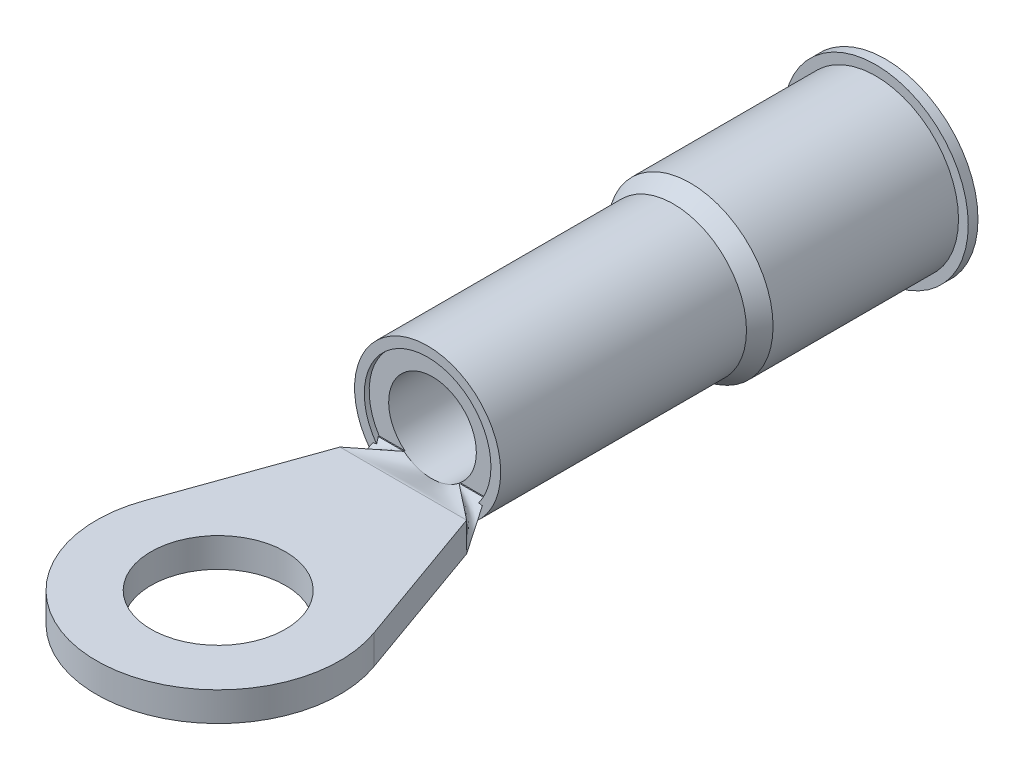
ISO-10303-21;
HEADER;
FILE_DESCRIPTION(('STEP AP214'),'2;1');
FILE_NAME('part.step','',(''),(''),'','','');
FILE_SCHEMA(('AUTOMOTIVE_DESIGN { 1 0 10303 214 1 1 1 1 }'));
ENDSEC;
DATA;
#1=APPLICATION_CONTEXT('core data for automotive mechanical design processes');
#2=APPLICATION_PROTOCOL_DEFINITION('international standard','automotive_design',2000,#1);
#3=PRODUCT_CONTEXT('',#1,'mechanical');
#4=PRODUCT('Part','Part','',(#3));
#5=PRODUCT_RELATED_PRODUCT_CATEGORY('part','',(#4));
#6=PRODUCT_DEFINITION_FORMATION('','',#4);
#7=PRODUCT_DEFINITION_CONTEXT('part definition',#1,'design');
#8=PRODUCT_DEFINITION('design','',#6,#7);
#9=PRODUCT_DEFINITION_SHAPE('','',#8);
#10=(LENGTH_UNIT() NAMED_UNIT(*) SI_UNIT(.MILLI.,.METRE.));
#11=(NAMED_UNIT(*) PLANE_ANGLE_UNIT() SI_UNIT($,.RADIAN.));
#12=(NAMED_UNIT(*) SI_UNIT($,.STERADIAN.) SOLID_ANGLE_UNIT());
#13=UNCERTAINTY_MEASURE_WITH_UNIT(LENGTH_MEASURE(1.E-05),#10,'distance_accuracy_value','');
#14=(GEOMETRIC_REPRESENTATION_CONTEXT(3) GLOBAL_UNCERTAINTY_ASSIGNED_CONTEXT((#13)) GLOBAL_UNIT_ASSIGNED_CONTEXT((#10,
#11,#12)) REPRESENTATION_CONTEXT('',''));
#15=CARTESIAN_POINT('',(0.,0.,0.));
#16=DIRECTION('',(0.,0.,1.));
#17=DIRECTION('',(1.,0.,0.));
#18=AXIS2_PLACEMENT_3D('',#15,#16,#17);
#19=CARTESIAN_POINT('',(-1.39121529606312,0.762,0.0254));
#20=CARTESIAN_POINT('',(-1.47781019737541,0.508,0.270933333333333));
#21=CARTESIAN_POINT('',(-1.56440509868771,0.254,0.516466666666667));
#22=CARTESIAN_POINT('',(-1.651,0.,0.762));
#23=CARTESIAN_POINT('',(-1.23955403655532,0.524662020194092,0.0254));
#24=CARTESIAN_POINT('',(-1.28498046881466,0.349774680129394,0.270933333333333));
#25=CARTESIAN_POINT('',(-1.330406901074,0.174887340064697,0.516466666666667));
#26=CARTESIAN_POINT('',(-1.37583333333333,0.,0.762));
#27=CARTESIAN_POINT('',(-0.83014051960649,0.143662020194092,0.0254));
#28=CARTESIAN_POINT('',(-0.82859367973766,0.0957746801293947,0.270933333333334));
#29=CARTESIAN_POINT('',(-0.82704683986883,0.0478873400646973,0.516466666666667));
#30=CARTESIAN_POINT('',(-0.8255,0.,0.762000000000001));
#31=CARTESIAN_POINT('',(0.,-0.0718310100970455,0.0254));
#32=CARTESIAN_POINT('',(0.,-0.047887340064697,0.270933333333333));
#33=CARTESIAN_POINT('',(0.,-0.0239436700323485,0.516466666666666));
#34=CARTESIAN_POINT('',(0.,0.,0.761999999999999));
#35=CARTESIAN_POINT('',(0.830140519606489,0.143662020194092,0.0254));
#36=CARTESIAN_POINT('',(0.828593679737659,0.0957746801293948,0.270933333333334));
#37=CARTESIAN_POINT('',(0.82704683986883,0.0478873400646974,0.516466666666667));
#38=CARTESIAN_POINT('',(0.8255,0.,0.762000000000001));
#39=CARTESIAN_POINT('',(1.23955403655532,0.524662020194091,0.0254));
#40=CARTESIAN_POINT('',(1.28498046881466,0.349774680129394,0.270933333333333));
#41=CARTESIAN_POINT('',(1.33040690107399,0.174887340064697,0.516466666666667));
#42=CARTESIAN_POINT('',(1.37583333333333,0.,0.762));
#43=CARTESIAN_POINT('',(1.39121529606312,0.761999999999999,0.0254));
#44=CARTESIAN_POINT('',(1.47781019737541,0.507999999999999,0.270933333333333));
#45=CARTESIAN_POINT('',(1.56440509868771,0.254,0.516466666666667));
#46=CARTESIAN_POINT('',(1.651,0.,0.762));
#47=B_SPLINE_SURFACE_WITH_KNOTS('',3,3,((#19,#20,#21,#22),(#23,#24,#25,#26),(#27,#28,#29,#30),
(#31,#32,#33,#34),(#35,#36,#37,#38),(#39,#40,#41,#42),(#43,#44,#45,#46)),.UNSPECIFIED.,.F.,.F.,
.F.,(4,1,1,1,4),(4,4),(0.,0.25,0.5,0.75,1.),(0.,1.),.UNSPECIFIED.);
#48=DIRECTION('',(0.238073071200388,0.698315480109153,-0.675038297438848));
#49=VECTOR('',#48,1.);
#50=CARTESIAN_POINT('',(-1.52110764803156,0.381,0.3937));
#51=LINE('',#50,#49);
#52=CARTESIAN_POINT('',(-1.651,0.,0.762));
#53=VERTEX_POINT('',#52);
#54=CARTESIAN_POINT('',(-1.42704766901993,0.656896551724138,0.127));
#55=VERTEX_POINT('',#54);
#56=EDGE_CURVE('E434',#53,#55,#51,.T.);
#57=CARTESIAN_POINT('',(-1.42704766901993,0.656896551724138,0.127));
#58=CARTESIAN_POINT('',(-1.39758191727476,0.621156019971046,0.127));
#59=CARTESIAN_POINT('',(-1.36669044147473,0.586618245457012,0.127));
#60=CARTESIAN_POINT('',(-1.30226329544282,0.520120364949861,0.127));
#61=CARTESIAN_POINT('',(-1.26872829772447,0.488159607520618,0.127));
#62=CARTESIAN_POINT('',(-1.16467924988584,0.396580652700039,0.127));
#63=CARTESIAN_POINT('',(-1.09052003773562,0.341023025084146,0.127));
#64=CARTESIAN_POINT('',(-0.929285470756384,0.238650935944051,0.127));
#65=CARTESIAN_POINT('',(-0.841675094746148,0.192685818214404,0.127));
#66=CARTESIAN_POINT('',(-0.66019061468465,0.115126560731954,0.127));
#67=CARTESIAN_POINT('',(-0.566309895673391,0.0835478816903494,0.127));
#68=CARTESIAN_POINT('',(-0.419844299965997,0.046371900769037,0.127));
#69=CARTESIAN_POINT('',(-0.368524098851723,0.0355340390327336,0.127));
#70=CARTESIAN_POINT('',(-0.265161649147126,0.0180561265052614,0.127));
#71=CARTESIAN_POINT('',(-0.213119427639096,0.0114159186968148,0.127));
#72=CARTESIAN_POINT('',(-0.108673566363522,0.00244437797419004,0.127));
#73=CARTESIAN_POINT('',(-0.0562699914721443,0.000112290822558793,0.127));
#74=CARTESIAN_POINT('',(0.0485457382792517,-0.000104238741521693,0.127));
#75=CARTESIAN_POINT('',(0.100957893091223,0.00201129473777937,0.127));
#76=CARTESIAN_POINT('',(0.206524326884028,0.0106467655091575,0.127));
#77=CARTESIAN_POINT('',(0.259671166651413,0.0172579957355603,0.127));
#78=CARTESIAN_POINT('',(0.36522394835596,0.0348561880133288,0.127));
#79=CARTESIAN_POINT('',(0.417629799086765,0.0458436839551839,0.127));
#80=CARTESIAN_POINT('',(0.573297522248406,0.0852546919277909,0.127));
#81=CARTESIAN_POINT('',(0.675022386288336,0.120127802259419,0.127));
#82=CARTESIAN_POINT('',(0.871986667874733,0.20731871631408,0.127));
#83=CARTESIAN_POINT('',(0.967144592048948,0.259820057509265,0.127));
#84=CARTESIAN_POINT('',(1.14626155002175,0.381128771582777,0.127));
#85=CARTESIAN_POINT('',(1.23024869613362,0.449893953605291,0.127));
#86=CARTESIAN_POINT('',(1.3281697677111,0.546529322523483,0.127));
#87=CARTESIAN_POINT('',(1.34874781009383,0.567905132476543,0.127));
#88=CARTESIAN_POINT('',(1.38875775940492,0.611655903662194,0.127));
#89=CARTESIAN_POINT('',(1.40819103259336,0.634029615454349,0.127));
#90=CARTESIAN_POINT('',(1.42704766901993,0.656896551724137,0.127));
#91=B_SPLINE_CURVE_WITH_KNOTS('',3,(#57,#58,#59,#60,#61,#62,#63,#64,#65,#66,#67,#68,#69,#70,#71,
#72,#73,#74,#75,#76,#77,#78,#79,#80,#81,#82,#83,#84,#85,#86,#87,#88,#89,#90),.UNSPECIFIED.,.F.,
.F.,(4,2,2,2,2,2,2,2,2,2,2,2,2,2,2,2,4),(0.,0.138884387927252,0.277733556910216,
0.554496905000208,0.850044656744678,1.14590928062392,1.30312528168604,1.46033540158456,
1.61751799555905,1.77469973753025,1.93517258639134,2.09566501842866,2.41661173840474,
2.74100934772726,3.06457447663388,3.15356286656676,3.24244280408155),.UNSPECIFIED.);
#92=CARTESIAN_POINT('',(1.42704766901993,0.656896551724138,0.127));
#93=VERTEX_POINT('',#92);
#94=EDGE_CURVE('E186',#55,#93,#91,.T.);
#95=DIRECTION('',(0.238073071200388,-0.698315480109153,0.675038297438848));
#96=VECTOR('',#95,1.);
#97=CARTESIAN_POINT('',(1.52110764803156,0.381,0.3937));
#98=LINE('',#97,#96);
#99=CARTESIAN_POINT('',(1.651,0.,0.762));
#100=VERTEX_POINT('',#99);
#101=EDGE_CURVE('E432',#93,#100,#98,.T.);
#102=DIRECTION('',(1.,0.,0.));
#103=VECTOR('',#102,1.);
#104=CARTESIAN_POINT('',(0.,0.,0.762));
#105=LINE('',#104,#103);
#106=EDGE_CURVE('E407',#100,#53,#105,.F.);
#107=ORIENTED_EDGE('',*,*,#56,.T.);
#108=ORIENTED_EDGE('',*,*,#94,.T.);
#109=ORIENTED_EDGE('',*,*,#101,.T.);
#110=ORIENTED_EDGE('',*,*,#106,.T.);
#111=EDGE_LOOP('',(#107,#108,#109,#110));
#112=FACE_BOUND('',#111,.T.);
#113=ADVANCED_FACE('F80',(#112),#47,.T.);
#114=CARTESIAN_POINT('',(-0.718420489685532,0.761999999999999,0.0254));
#115=CARTESIAN_POINT('',(-1.02928032645702,0.762,0.270933333333333));
#116=CARTESIAN_POINT('',(-1.34014016322851,0.762,0.516466666666667));
#117=CARTESIAN_POINT('',(-1.651,0.762,0.762));
#118=CARTESIAN_POINT('',(-0.774486723550331,0.761999999999999,0.0254));
#119=CARTESIAN_POINT('',(-1.06665781570022,0.740833333333333,0.270933333333333));
#120=CARTESIAN_POINT('',(-1.35882890785011,0.719666666666666,0.516466666666667));
#121=CARTESIAN_POINT('',(-1.651,0.6985,0.762));
#122=CARTESIAN_POINT('',(-0.88661919127993,0.761999999999999,0.0254));
#123=CARTESIAN_POINT('',(-1.14141279418662,0.6985,0.270933333333333));
#124=CARTESIAN_POINT('',(-1.39620639709331,0.635,0.516466666666666));
#125=CARTESIAN_POINT('',(-1.651,0.5715,0.762));
#126=CARTESIAN_POINT('',(-1.05481789287433,0.762,0.0254));
#127=CARTESIAN_POINT('',(-1.25354526191622,0.635,0.270933333333334));
#128=CARTESIAN_POINT('',(-1.45227263095811,0.508,0.516466666666668));
#129=CARTESIAN_POINT('',(-1.651,0.381,0.762000000000001));
#130=CARTESIAN_POINT('',(-1.22301659446872,0.761999999999999,0.0254));
#131=CARTESIAN_POINT('',(-1.36567772964582,0.5715,0.270933333333333));
#132=CARTESIAN_POINT('',(-1.50833886482291,0.381,0.516466666666666));
#133=CARTESIAN_POINT('',(-1.651,0.1905,0.761999999999999));
#134=CARTESIAN_POINT('',(-1.33514906219832,0.761999999999999,0.0254));
#135=CARTESIAN_POINT('',(-1.44043270813221,0.529166666666666,0.270933333333333));
#136=CARTESIAN_POINT('',(-1.54571635406611,0.296333333333333,0.516466666666667));
#137=CARTESIAN_POINT('',(-1.651,0.0635000000000003,0.762));
#138=CARTESIAN_POINT('',(-1.39121529606312,0.761999999999999,0.0254));
#139=CARTESIAN_POINT('',(-1.47781019737541,0.508,0.270933333333333));
#140=CARTESIAN_POINT('',(-1.56440509868771,0.254,0.516466666666667));
#141=CARTESIAN_POINT('',(-1.651,0.,0.762));
#142=B_SPLINE_SURFACE_WITH_KNOTS('',3,3,((#114,#115,#116,#117),(#118,#119,#120,#121),(#122,#123,
#124,#125),(#126,#127,#128,#129),(#130,#131,#132,#133),(#134,#135,#136,#137),(#138,#139,#140,
#141)),.UNSPECIFIED.,.F.,.F.,.F.,(4,1,1,1,4),(4,4),(0.809457468958157,0.857093101718618,
0.904728734479079,0.952364367239539,1.),(0.,1.),.UNSPECIFIED.);
#143=CARTESIAN_POINT('',(-1.39121529606312,0.762,0.0253999999999994));
#144=CARTESIAN_POINT('',(-1.38608855288108,0.753975647520577,0.0331610564142781));
#145=CARTESIAN_POINT('',(-1.38094789781283,0.746085406524645,0.0410563370567257));
#146=CARTESIAN_POINT('',(-1.3707085552637,0.730650018927489,0.0571622428158725));
#147=CARTESIAN_POINT('',(-1.36560980035942,0.723104151700813,0.0653721364053272));
#148=CARTESIAN_POINT('',(-1.3554998256097,0.708396876537606,0.0821896660357152));
#149=CARTESIAN_POINT('',(-1.35048862622041,0.701235557656195,0.0907973933569945));
#150=CARTESIAN_POINT('',(-1.34063818539088,0.687379878571269,0.108509285916107));
#151=CARTESIAN_POINT('',(-1.33579934700954,0.680686581615087,0.117614502831048));
#152=CARTESIAN_POINT('',(-1.33109964648684,0.674283699776335,0.126999999999995));
#153=B_SPLINE_CURVE_WITH_KNOTS('',3,(#143,#144,#145,#146,#147,#148,#149,#150,#151,#152),
.UNSPECIFIED.,.F.,.F.,(4,2,2,2,4),(0.,0.0368561073399838,0.0736311779630064,0.110414728684775,
0.147279297482322),.UNSPECIFIED.);
#154=CARTESIAN_POINT('',(-1.39121529606312,0.762,0.0254000000000001));
#155=VERTEX_POINT('',#154);
#156=CARTESIAN_POINT('',(-1.33109964648684,0.674283699776336,0.127));
#157=VERTEX_POINT('',#156);
#158=EDGE_CURVE('E176',#155,#157,#153,.T.);
#159=CARTESIAN_POINT('',(-0.847052146280631,0.761999999999999,0.127));
#160=CARTESIAN_POINT('',(-0.89873164530666,0.75263493882306,0.127));
#161=CARTESIAN_POINT('',(-0.950411144332689,0.74326987764612,0.127));
#162=CARTESIAN_POINT('',(-1.05377014238475,0.724539755292241,0.127));
#163=CARTESIAN_POINT('',(-1.10544964141078,0.715174694115301,0.127));
#164=CARTESIAN_POINT('',(-1.24710198329785,0.68950527253362,0.127));
#165=CARTESIAN_POINT('',(-1.33707482615889,0.673200912128879,0.127));
#166=CARTESIAN_POINT('',(-1.42704766901993,0.656896551724137,0.127));
#167=B_SPLINE_CURVE_WITH_KNOTS('',3,(#159,#160,#161,#162,#163,#164,#165,#166),.UNSPECIFIED.,.F.,
.F.,(4,2,2,4),(0.,0.157563558330797,0.315127116661593,0.589441719966538),.UNSPECIFIED.);
#168=EDGE_CURVE('E310',#157,#55,#167,.T.);
#169=DIRECTION('',(0.,1.,0.));
#170=VECTOR('',#169,1.);
#171=CARTESIAN_POINT('',(-1.651,0.762,0.762));
#172=LINE('',#171,#170);
#173=CARTESIAN_POINT('',(-1.651,0.762,0.761999999999999));
#174=VERTEX_POINT('',#173);
#175=EDGE_CURVE('E420',#174,#53,#172,.F.);
#176=DIRECTION('',(-0.784738272337792,0.,0.619827269429393));
#177=VECTOR('',#176,1.);
#178=CARTESIAN_POINT('',(-1.18471024484277,0.762,0.3937));
#179=LINE('',#178,#177);
#180=CARTESIAN_POINT('',(-0.718420489685532,0.762,0.0254));
#181=VERTEX_POINT('',#180);
#182=EDGE_CURVE('E206',#181,#174,#179,.T.);
#183=DIRECTION('',(-1.,0.,0.));
#184=VECTOR('',#183,1.);
#185=CARTESIAN_POINT('',(-0.718420489685532,0.761999999999999,0.0254));
#186=LINE('',#185,#184);
#187=EDGE_CURVE('E194',#181,#155,#186,.T.);
#188=ORIENTED_EDGE('',*,*,#158,.T.);
#189=ORIENTED_EDGE('',*,*,#168,.T.);
#190=ORIENTED_EDGE('',*,*,#56,.F.);
#191=ORIENTED_EDGE('',*,*,#175,.F.);
#192=ORIENTED_EDGE('',*,*,#182,.F.);
#193=ORIENTED_EDGE('',*,*,#187,.T.);
#194=EDGE_LOOP('',(#188,#189,#190,#191,#192,#193));
#195=FACE_BOUND('',#194,.T.);
#196=ADVANCED_FACE('F203',(#195),#142,.T.);
#197=CARTESIAN_POINT('',(0.718420489685532,0.761999999999999,0.0254));
#198=CARTESIAN_POINT('',(1.02928032645702,0.762,0.270933333333333));
#199=CARTESIAN_POINT('',(1.34014016322851,0.762,0.516466666666667));
#200=CARTESIAN_POINT('',(1.651,0.762,0.762));
#201=CARTESIAN_POINT('',(0.617715486250442,0.680618067624724,0.0254));
#202=CARTESIAN_POINT('',(0.870421435278072,0.707745378416483,0.270933333333333));
#203=CARTESIAN_POINT('',(1.1231273843057,0.734872689208241,0.516466666666667));
#204=CARTESIAN_POINT('',(1.37583333333333,0.762,0.762));
#205=CARTESIAN_POINT('',(0.388426025516563,0.552394071071588,0.0254000000000001));
#206=CARTESIAN_POINT('',(0.534117350344376,0.622262714047725,0.270933333333333));
#207=CARTESIAN_POINT('',(0.679808675172188,0.692131357023863,0.516466666666667));
#208=CARTESIAN_POINT('',(0.825500000000001,0.762,0.762));
#209=CARTESIAN_POINT('',(0.,0.485773897218784,0.0254));
#210=CARTESIAN_POINT('',(0.,0.577849264812523,0.270933333333333));
#211=CARTESIAN_POINT('',(0.,0.669924632406261,0.516466666666667));
#212=CARTESIAN_POINT('',(0.,0.762,0.762));
#213=CARTESIAN_POINT('',(-0.388426025516564,0.552394071071588,0.0254));
#214=CARTESIAN_POINT('',(-0.534117350344376,0.622262714047725,0.270933333333333));
#215=CARTESIAN_POINT('',(-0.679808675172188,0.692131357023863,0.516466666666667));
#216=CARTESIAN_POINT('',(-0.8255,0.762,0.762));
#217=CARTESIAN_POINT('',(-0.617715486250443,0.680618067624724,0.0254));
#218=CARTESIAN_POINT('',(-0.870421435278073,0.707745378416483,0.270933333333333));
#219=CARTESIAN_POINT('',(-1.1231273843057,0.734872689208241,0.516466666666667));
#220=CARTESIAN_POINT('',(-1.37583333333333,0.762,0.762));
#221=CARTESIAN_POINT('',(-0.718420489685532,0.761999999999999,0.0254));
#222=CARTESIAN_POINT('',(-1.02928032645702,0.762,0.270933333333333));
#223=CARTESIAN_POINT('',(-1.34014016322851,0.762,0.516466666666667));
#224=CARTESIAN_POINT('',(-1.651,0.762,0.762));
#225=B_SPLINE_SURFACE_WITH_KNOTS('',3,3,((#197,#198,#199,#200),(#201,#202,#203,#204),(#205,#206,
#207,#208),(#209,#210,#211,#212),(#213,#214,#215,#216),(#217,#218,#219,#220),(#221,#222,#223,
#224)),.UNSPECIFIED.,.F.,.F.,.F.,(4,1,1,1,4),(4,4),(0.190542531041843,0.345271265520921,0.5,
0.654728734479079,0.809457468958157),(0.,1.),.UNSPECIFIED.);
#226=CARTESIAN_POINT('',(0.,1.651,0.0254));
#227=DIRECTION('',(0.,0.,-1.));
#228=DIRECTION('',(1.,0.,0.));
#229=AXIS2_PLACEMENT_3D('',#226,#227,#228);
#230=CIRCLE('',#229,1.143);
#231=CARTESIAN_POINT('',(0.718420489685532,0.761999999999999,0.0254));
#232=VERTEX_POINT('',#231);
#233=CARTESIAN_POINT('',(0.280093594641271,0.542819573389863,0.0254));
#234=VERTEX_POINT('',#233);
#235=EDGE_CURVE('E208',#232,#234,#230,.T.);
#236=CARTESIAN_POINT('',(0.280086317799953,0.542848090476192,0.0254));
#237=CARTESIAN_POINT('',(0.274435453146551,0.541419829924682,0.0253898757300014));
#238=CARTESIAN_POINT('',(0.268773634953075,0.540034876181237,0.0253815517042047));
#239=CARTESIAN_POINT('',(0.256810333648759,0.537205395040891,0.025367029172351));
#240=CARTESIAN_POINT('',(0.250506484126485,0.535770865005437,0.0253611618348143));
#241=CARTESIAN_POINT('',(0.237253661374286,0.532873047210581,0.0253515275315568));
#242=CARTESIAN_POINT('',(0.23030226611733,0.531420828445981,0.0253480241666326));
#243=CARTESIAN_POINT('',(0.215749315169803,0.528521761640067,0.0253431953071069));
#244=CARTESIAN_POINT('',(0.208145337102078,0.527087064644947,0.0253420931933865));
#245=CARTESIAN_POINT('',(0.192282898443226,0.52426052919858,0.0253420952879215));
#246=CARTESIAN_POINT('',(0.184022076020688,0.522881934751302,0.0253433885339403));
#247=CARTESIAN_POINT('',(0.166842658096937,0.520208501393833,0.0253482149334854));
#248=CARTESIAN_POINT('',(0.157921827716278,0.518928010945526,0.0253519109914221));
#249=CARTESIAN_POINT('',(0.139420476007071,0.516495147330165,0.025361559850228));
#250=CARTESIAN_POINT('',(0.129837918764648,0.515358239536721,0.0253676537671633));
#251=CARTESIAN_POINT('',(0.110012945822629,0.513260419584125,0.025382142066703));
#252=CARTESIAN_POINT('',(0.0997687718967419,0.512316102862729,0.0253906618603731));
#253=CARTESIAN_POINT('',(0.0895136704791261,0.511510507816197,0.0254));
#254=B_SPLINE_CURVE_WITH_KNOTS('',3,(#236,#237,#238,#239,#240,#241,#242,#243,#244,#245,#246,
#247,#248,#249,#250,#251,#252,#253),.UNSPECIFIED.,.F.,.F.,(4,2,2,2,2,2,2,2,4),(0.,
0.0174855734570703,0.0368796879760257,0.0581828587489586,0.0813956904950005,0.10651886566124,
0.133553138647615,0.162499343526083,0.193358425668611),.UNSPECIFIED.);
#255=CARTESIAN_POINT('',(0.089516606997273,0.511472074409526,0.0254));
#256=VERTEX_POINT('',#255);
#257=EDGE_CURVE('E13',#234,#256,#254,.T.);
#258=CARTESIAN_POINT('',(0.718420489685532,0.761999999999999,0.0254));
#259=CARTESIAN_POINT('',(0.617715486250442,0.680618067624724,0.0254));
#260=CARTESIAN_POINT('',(0.388426025516563,0.552394071071588,0.0254000000000001));
#261=CARTESIAN_POINT('',(0.,0.485773897218784,0.0254));
#262=CARTESIAN_POINT('',(-0.388426025516564,0.552394071071588,0.0254));
#263=CARTESIAN_POINT('',(-0.617715486250443,0.680618067624724,0.0254));
#264=CARTESIAN_POINT('',(-0.718420489685532,0.761999999999999,0.0254));
#265=B_SPLINE_CURVE_WITH_KNOTS('',3,(#258,#259,#260,#261,#262,#263,#264),.UNSPECIFIED.,.F.,.F.,
(4,1,1,1,4),(0.190542531041843,0.345271265520921,0.5,0.654728734479079,0.809457468958157),.UNSPECIFIED.);
#266=CARTESIAN_POINT('',(-0.0895153171618941,0.51148892797954,0.0254));
#267=VERTEX_POINT('',#266);
#268=EDGE_CURVE('E199',#256,#267,#265,.T.);
#269=CARTESIAN_POINT('',(-0.0895136706448394,0.511510507829265,0.0254));
#270=CARTESIAN_POINT('',(-0.0997687720410653,0.512316102875615,0.0253906618603894));
#271=CARTESIAN_POINT('',(-0.110012945945588,0.513260419596252,0.0253821420667349));
#272=CARTESIAN_POINT('',(-0.1298379188475,0.515358239546391,0.0253676537672216));
#273=CARTESIAN_POINT('',(-0.139420476071171,0.516495147338236,0.0253615598502975));
#274=CARTESIAN_POINT('',(-0.157921827745502,0.518928010949762,0.025351910991509));
#275=CARTESIAN_POINT('',(-0.166842658110025,0.520208501395922,0.0253482149335793));
#276=CARTESIAN_POINT('',(-0.184022076004126,0.52288193474873,0.0253433885340428));
#277=CARTESIAN_POINT('',(-0.192282898413135,0.524260529193574,0.0253420952880267));
#278=CARTESIAN_POINT('',(-0.208145337047529,0.527087064634951,0.0253420931934917));
#279=CARTESIAN_POINT('',(-0.215749315104312,0.528521761627587,0.0253431953072103));
#280=CARTESIAN_POINT('',(-0.230302266032525,0.531420828428625,0.0253480241667272));
#281=CARTESIAN_POINT('',(-0.237253661281096,0.532873047190899,0.0253515275316453));
#282=CARTESIAN_POINT('',(-0.250506484019064,0.535770864981382,0.0253611618348855));
#283=CARTESIAN_POINT('',(-0.256810333535479,0.537205395014848,0.0253670291724122));
#284=CARTESIAN_POINT('',(-0.268773634830581,0.540034876151665,0.0253815517042392));
#285=CARTESIAN_POINT('',(-0.27443545302069,0.541419829893615,0.0253898757300211));
#286=CARTESIAN_POINT('',(-0.280086317670744,0.542848090443578,0.0254));
#287=B_SPLINE_CURVE_WITH_KNOTS('',3,(#269,#270,#271,#272,#273,#274,#275,#276,#277,#278,#279,
#280,#281,#282,#283,#284,#285,#286),.UNSPECIFIED.,.F.,.F.,(4,2,2,2,2,2,2,2,4),(0.,
0.0308590820785189,0.0598052869005761,0.0868395598381356,0.111962734963151,0.135175566675559,
0.156478737422446,0.175872851922941,0.193358425369136),.UNSPECIFIED.);
#288=CARTESIAN_POINT('',(-0.280097541124282,0.542804046174763,0.0254));
#289=VERTEX_POINT('',#288);
#290=EDGE_CURVE('E91',#267,#289,#287,.T.);
#291=CARTESIAN_POINT('',(0.718420489685532,0.761999999999999,0.0254));
#292=CARTESIAN_POINT('',(0.617715486250442,0.680618067624724,0.0254));
#293=CARTESIAN_POINT('',(0.388426025516563,0.552394071071588,0.0254000000000001));
#294=CARTESIAN_POINT('',(0.,0.485773897218784,0.0254));
#295=CARTESIAN_POINT('',(-0.388426025516564,0.552394071071588,0.0254));
#296=CARTESIAN_POINT('',(-0.617715486250443,0.680618067624724,0.0254));
#297=CARTESIAN_POINT('',(-0.718420489685532,0.761999999999999,0.0254));
#298=B_SPLINE_CURVE_WITH_KNOTS('',3,(#291,#292,#293,#294,#295,#296,#297),.UNSPECIFIED.,.F.,.F.,
(4,1,1,1,4),(0.190542531041843,0.345271265520921,0.5,0.654728734479079,0.809457468958157),.UNSPECIFIED.);
#299=EDGE_CURVE('E334',#289,#181,#298,.T.);
#300=DIRECTION('',(1.,0.,0.));
#301=VECTOR('',#300,1.);
#302=CARTESIAN_POINT('',(0.,0.762,0.762));
#303=LINE('',#302,#301);
#304=CARTESIAN_POINT('',(1.651,0.762,0.762));
#305=VERTEX_POINT('',#304);
#306=EDGE_CURVE('E423',#305,#174,#303,.F.);
#307=DIRECTION('',(0.784738272337792,0.,0.619827269429393));
#308=VECTOR('',#307,1.);
#309=CARTESIAN_POINT('',(1.18471024484277,0.762,0.3937));
#310=LINE('',#309,#308);
#311=EDGE_CURVE('E302',#232,#305,#310,.T.);
#312=ORIENTED_EDGE('',*,*,#235,.T.);
#313=ORIENTED_EDGE('',*,*,#257,.T.);
#314=ORIENTED_EDGE('',*,*,#268,.T.);
#315=ORIENTED_EDGE('',*,*,#290,.T.);
#316=ORIENTED_EDGE('',*,*,#299,.T.);
#317=ORIENTED_EDGE('',*,*,#182,.T.);
#318=ORIENTED_EDGE('',*,*,#306,.F.);
#319=ORIENTED_EDGE('',*,*,#311,.F.);
#320=EDGE_LOOP('',(#312,#313,#314,#315,#316,#317,#318,#319));
#321=FACE_BOUND('',#320,.T.);
#322=ADVANCED_FACE('F232',(#321),#225,.T.);
#323=CARTESIAN_POINT('',(1.39121529606312,0.761999999999999,0.0254));
#324=CARTESIAN_POINT('',(1.47781019737541,0.508,0.270933333333333));
#325=CARTESIAN_POINT('',(1.56440509868771,0.254,0.516466666666667));
#326=CARTESIAN_POINT('',(1.651,0.,0.762));
#327=CARTESIAN_POINT('',(1.33514906219832,0.761999999999999,0.0254));
#328=CARTESIAN_POINT('',(1.44043270813221,0.529166666666666,0.270933333333333));
#329=CARTESIAN_POINT('',(1.54571635406611,0.296333333333333,0.516466666666667));
#330=CARTESIAN_POINT('',(1.651,0.0635000000000002,0.762));
#331=CARTESIAN_POINT('',(1.22301659446872,0.761999999999999,0.0254));
#332=CARTESIAN_POINT('',(1.36567772964582,0.571499999999999,0.270933333333333));
#333=CARTESIAN_POINT('',(1.50833886482291,0.381,0.516466666666667));
#334=CARTESIAN_POINT('',(1.651,0.1905,0.762));
#335=CARTESIAN_POINT('',(1.05481789287433,0.762000000000001,0.0254));
#336=CARTESIAN_POINT('',(1.25354526191622,0.635,0.270933333333334));
#337=CARTESIAN_POINT('',(1.45227263095811,0.508000000000001,0.516466666666667));
#338=CARTESIAN_POINT('',(1.651,0.381000000000001,0.762000000000001));
#339=CARTESIAN_POINT('',(0.886619191279928,0.761999999999998,0.0254));
#340=CARTESIAN_POINT('',(1.14141279418662,0.698499999999999,0.270933333333333));
#341=CARTESIAN_POINT('',(1.39620639709331,0.634999999999999,0.516466666666666));
#342=CARTESIAN_POINT('',(1.651,0.5715,0.761999999999999));
#343=CARTESIAN_POINT('',(0.774486723550331,0.761999999999999,0.0254));
#344=CARTESIAN_POINT('',(1.06665781570022,0.740833333333333,0.270933333333333));
#345=CARTESIAN_POINT('',(1.35882890785011,0.719666666666667,0.516466666666667));
#346=CARTESIAN_POINT('',(1.651,0.6985,0.762));
#347=CARTESIAN_POINT('',(0.718420489685532,0.761999999999999,0.0254));
#348=CARTESIAN_POINT('',(1.02928032645702,0.762,0.270933333333333));
#349=CARTESIAN_POINT('',(1.34014016322851,0.762,0.516466666666667));
#350=CARTESIAN_POINT('',(1.651,0.762,0.762));
#351=B_SPLINE_SURFACE_WITH_KNOTS('',3,3,((#323,#324,#325,#326),(#327,#328,#329,#330),(#331,#332,
#333,#334),(#335,#336,#337,#338),(#339,#340,#341,#342),(#343,#344,#345,#346),(#347,#348,#349,
#350)),.UNSPECIFIED.,.F.,.F.,.F.,(4,1,1,1,4),(4,4),(0.,0.0476356327604607,0.0952712655209215,
0.142906898281382,0.190542531041843),(0.,1.),.UNSPECIFIED.);
#352=CARTESIAN_POINT('',(1.42704766901993,0.656896551724138,0.127));
#353=CARTESIAN_POINT('',(1.3753681699939,0.666261612901078,0.127));
#354=CARTESIAN_POINT('',(1.32368867096786,0.675626674078019,0.127));
#355=CARTESIAN_POINT('',(1.22032967291579,0.6943567964319,0.127));
#356=CARTESIAN_POINT('',(1.16865017388976,0.703721857608841,0.127));
#357=CARTESIAN_POINT('',(1.02699783200269,0.729391279190522,0.127));
#358=CARTESIAN_POINT('',(0.937024989141662,0.745695639595261,0.127));
#359=CARTESIAN_POINT('',(0.847052146280631,0.762,0.127));
#360=B_SPLINE_CURVE_WITH_KNOTS('',3,(#352,#353,#354,#355,#356,#357,#358,#359),.UNSPECIFIED.,.F.,
.F.,(4,2,2,4),(0.,0.157563558330814,0.315127116661628,0.58944171996654),.UNSPECIFIED.);
#361=CARTESIAN_POINT('',(1.33109964649123,0.674283699782314,0.127));
#362=VERTEX_POINT('',#361);
#363=EDGE_CURVE('E271',#93,#362,#360,.T.);
#364=CARTESIAN_POINT('',(1.33109964649391,0.674283699780344,0.12699999999676));
#365=CARTESIAN_POINT('',(1.33579934701372,0.680686581618788,0.117614502826859));
#366=CARTESIAN_POINT('',(1.34063818539373,0.68737987857469,0.108509285911823));
#367=CARTESIAN_POINT('',(1.35048862622201,0.701235557659042,0.0907973933532686));
#368=CARTESIAN_POINT('',(1.35549982561136,0.708396876540158,0.0821896660326391));
#369=CARTESIAN_POINT('',(1.36560980036082,0.723104151702711,0.0653721364033144));
#370=CARTESIAN_POINT('',(1.37070855526479,0.730650018929025,0.057162242814273));
#371=CARTESIAN_POINT('',(1.38094789781329,0.746085406525429,0.041056337055906));
#372=CARTESIAN_POINT('',(1.38608855288121,0.753975647520971,0.0331610564138253));
#373=CARTESIAN_POINT('',(1.39121529606312,0.761999999999999,0.0254));
#374=B_SPLINE_CURVE_WITH_KNOTS('',3,(#364,#365,#366,#367,#368,#369,#370,#371,#372,#373),
.UNSPECIFIED.,.F.,.F.,(4,2,2,2,4),(0.,0.0368645687957489,0.0736481195156765,0.110423190136819,
0.147279297474967),.UNSPECIFIED.);
#375=CARTESIAN_POINT('',(1.39121529606312,0.761999999999999,0.0254));
#376=VERTEX_POINT('',#375);
#377=EDGE_CURVE('E269',#362,#376,#374,.T.);
#378=DIRECTION('',(-1.,0.,0.));
#379=VECTOR('',#378,1.);
#380=CARTESIAN_POINT('',(1.39121529606312,0.761999999999999,0.0254));
#381=LINE('',#380,#379);
#382=EDGE_CURVE('E84',#376,#232,#381,.T.);
#383=DIRECTION('',(0.,1.,0.));
#384=VECTOR('',#383,1.);
#385=CARTESIAN_POINT('',(1.651,0.762,0.762));
#386=LINE('',#385,#384);
#387=EDGE_CURVE('E418',#305,#100,#386,.F.);
#388=ORIENTED_EDGE('',*,*,#101,.F.);
#389=ORIENTED_EDGE('',*,*,#363,.T.);
#390=ORIENTED_EDGE('',*,*,#377,.T.);
#391=ORIENTED_EDGE('',*,*,#382,.T.);
#392=ORIENTED_EDGE('',*,*,#311,.T.);
#393=ORIENTED_EDGE('',*,*,#387,.T.);
#394=EDGE_LOOP('',(#388,#389,#390,#391,#392,#393));
#395=FACE_BOUND('',#394,.T.);
#396=ADVANCED_FACE('F276',(#395),#351,.T.);
#397=CARTESIAN_POINT('',(0.,0.762,5.588));
#398=DIRECTION('',(0.,1.,0.));
#399=DIRECTION('',(0.,0.,1.));
#400=AXIS2_PLACEMENT_3D('',#397,#398,#399);
#401=PLANE('',#400);
#402=ORIENTED_EDGE('',*,*,#306,.T.);
#403=DIRECTION('',(-0.335634175583977,0.,0.941992409831451));
#404=VECTOR('',#403,1.);
#405=CARTESIAN_POINT('',(-1.651,0.762,0.762));
#406=LINE('',#405,#404);
#407=CARTESIAN_POINT('',(-2.99082590121486,0.762,4.52236149252087));
#408=VERTEX_POINT('',#407);
#409=EDGE_CURVE('E113',#174,#408,#406,.T.);
#410=ORIENTED_EDGE('',*,*,#409,.T.);
#411=CARTESIAN_POINT('',(0.,0.762,5.588));
#412=DIRECTION('',(0.,1.,0.));
#413=DIRECTION('',(0.,0.,1.));
#414=AXIS2_PLACEMENT_3D('',#411,#412,#413);
#415=CIRCLE('',#414,3.175);
#416=CARTESIAN_POINT('',(2.99082590121486,0.762,4.52236149252087));
#417=VERTEX_POINT('',#416);
#418=EDGE_CURVE('E410',#408,#417,#415,.T.);
#419=ORIENTED_EDGE('',*,*,#418,.T.);
#420=DIRECTION('',(-0.335634175583977,0.,-0.941992409831451));
#421=VECTOR('',#420,1.);
#422=CARTESIAN_POINT('',(1.651,0.762,0.762));
#423=LINE('',#422,#421);
#424=EDGE_CURVE('E99',#417,#305,#423,.T.);
#425=ORIENTED_EDGE('',*,*,#424,.T.);
#426=EDGE_LOOP('',(#402,#410,#419,#425));
#427=FACE_BOUND('',#426,.T.);
#428=CARTESIAN_POINT('',(0.,0.762,5.588));
#429=DIRECTION('',(0.,1.,0.));
#430=DIRECTION('',(0.,0.,1.));
#431=AXIS2_PLACEMENT_3D('',#428,#429,#430);
#432=CIRCLE('',#431,1.7526);
#433=CARTESIAN_POINT('',(0.,0.762,3.8354));
#434=VERTEX_POINT('',#433);
#435=EDGE_CURVE('E404',#434,#434,#432,.T.);
#436=ORIENTED_EDGE('',*,*,#435,.F.);
#437=EDGE_LOOP('',(#436));
#438=FACE_BOUND('',#437,.T.);
#439=ADVANCED_FACE('F282',(#427,#438),#401,.T.);
#440=CARTESIAN_POINT('',(0.,0.,5.588));
#441=DIRECTION('',(0.,1.,0.));
#442=DIRECTION('',(0.,0.,1.));
#443=AXIS2_PLACEMENT_3D('',#440,#441,#442);
#444=PLANE('',#443);
#445=ORIENTED_EDGE('',*,*,#106,.F.);
#446=DIRECTION('',(-0.335634175583977,0.,-0.941992409831451));
#447=VECTOR('',#446,1.);
#448=CARTESIAN_POINT('',(1.651,0.,0.762));
#449=LINE('',#448,#447);
#450=CARTESIAN_POINT('',(2.99082590121486,0.,4.52236149252087));
#451=VERTEX_POINT('',#450);
#452=EDGE_CURVE('E413',#451,#100,#449,.T.);
#453=ORIENTED_EDGE('',*,*,#452,.F.);
#454=CARTESIAN_POINT('',(0.,0.,5.588));
#455=DIRECTION('',(0.,1.,0.));
#456=DIRECTION('',(0.,0.,1.));
#457=AXIS2_PLACEMENT_3D('',#454,#455,#456);
#458=CIRCLE('',#457,3.175);
#459=CARTESIAN_POINT('',(-2.99082590121486,0.,4.52236149252087));
#460=VERTEX_POINT('',#459);
#461=EDGE_CURVE('E121',#460,#451,#458,.T.);
#462=ORIENTED_EDGE('',*,*,#461,.F.);
#463=DIRECTION('',(-0.335634175583977,0.,0.941992409831451));
#464=VECTOR('',#463,1.);
#465=CARTESIAN_POINT('',(-1.651,0.,0.762));
#466=LINE('',#465,#464);
#467=EDGE_CURVE('E414',#53,#460,#466,.T.);
#468=ORIENTED_EDGE('',*,*,#467,.F.);
#469=EDGE_LOOP('',(#445,#453,#462,#468));
#470=FACE_BOUND('',#469,.T.);
#471=CARTESIAN_POINT('',(0.,0.,5.588));
#472=DIRECTION('',(0.,1.,0.));
#473=DIRECTION('',(0.,0.,1.));
#474=AXIS2_PLACEMENT_3D('',#471,#472,#473);
#475=CIRCLE('',#474,1.7526);
#476=CARTESIAN_POINT('',(0.,0.,3.8354));
#477=VERTEX_POINT('',#476);
#478=EDGE_CURVE('E207',#477,#477,#475,.T.);
#479=ORIENTED_EDGE('',*,*,#478,.T.);
#480=EDGE_LOOP('',(#479));
#481=FACE_BOUND('',#480,.T.);
#482=ADVANCED_FACE('F579',(#470,#481),#444,.F.);
#483=CARTESIAN_POINT('',(-1.651,0.762,0.762));
#484=DIRECTION('',(0.941992409831451,0.,0.335634175583977));
#485=DIRECTION('',(0.335634175583977,0.,-0.941992409831451));
#486=AXIS2_PLACEMENT_3D('',#483,#484,#485);
#487=PLANE('',#486);
#488=ORIENTED_EDGE('',*,*,#467,.T.);
#489=DIRECTION('',(0.,-1.,0.));
#490=VECTOR('',#489,1.);
#491=CARTESIAN_POINT('',(-2.99082590121486,0.762,4.52236149252087));
#492=LINE('',#491,#490);
#493=EDGE_CURVE('E417',#408,#460,#492,.T.);
#494=ORIENTED_EDGE('',*,*,#493,.F.);
#495=ORIENTED_EDGE('',*,*,#409,.F.);
#496=ORIENTED_EDGE('',*,*,#175,.T.);
#497=EDGE_LOOP('',(#488,#494,#495,#496));
#498=FACE_BOUND('',#497,.T.);
#499=ADVANCED_FACE('F82',(#498),#487,.F.);
#500=CARTESIAN_POINT('',(0.,0.762,5.588));
#501=DIRECTION('',(0.,-1.,0.));
#502=DIRECTION('',(0.,0.,-1.));
#503=AXIS2_PLACEMENT_3D('',#500,#501,#502);
#504=CYLINDRICAL_SURFACE('',#503,3.175);
#505=ORIENTED_EDGE('',*,*,#461,.T.);
#506=DIRECTION('',(0.,-1.,0.));
#507=VECTOR('',#506,1.);
#508=CARTESIAN_POINT('',(2.99082590121486,0.762,4.52236149252087));
#509=LINE('',#508,#507);
#510=EDGE_CURVE('E415',#417,#451,#509,.T.);
#511=ORIENTED_EDGE('',*,*,#510,.F.);
#512=ORIENTED_EDGE('',*,*,#418,.F.);
#513=ORIENTED_EDGE('',*,*,#493,.T.);
#514=EDGE_LOOP('',(#505,#511,#512,#513));
#515=FACE_BOUND('',#514,.T.);
#516=ADVANCED_FACE('F592',(#515),#504,.T.);
#517=CARTESIAN_POINT('',(1.651,0.762,0.762));
#518=DIRECTION('',(-0.941992409831451,0.,0.335634175583977));
#519=DIRECTION('',(0.335634175583977,0.,0.941992409831451));
#520=AXIS2_PLACEMENT_3D('',#517,#518,#519);
#521=PLANE('',#520);
#522=ORIENTED_EDGE('',*,*,#452,.T.);
#523=ORIENTED_EDGE('',*,*,#387,.F.);
#524=ORIENTED_EDGE('',*,*,#424,.F.);
#525=ORIENTED_EDGE('',*,*,#510,.T.);
#526=EDGE_LOOP('',(#522,#523,#524,#525));
#527=FACE_BOUND('',#526,.T.);
#528=ADVANCED_FACE('F599',(#527),#521,.F.);
#529=CARTESIAN_POINT('',(0.,0.762,5.588));
#530=DIRECTION('',(0.,-1.,0.));
#531=DIRECTION('',(0.,0.,-1.));
#532=AXIS2_PLACEMENT_3D('',#529,#530,#531);
#533=CYLINDRICAL_SURFACE('',#532,1.7526);
#534=CARTESIAN_POINT('',(0.,0.762,3.8354));
#535=CARTESIAN_POINT('',(0.,0.7540625,3.8354));
#536=CARTESIAN_POINT('',(0.,0.746125,3.8354));
#537=CARTESIAN_POINT('',(0.,0.73025,3.8354));
#538=CARTESIAN_POINT('',(0.,0.7223125,3.8354));
#539=CARTESIAN_POINT('',(0.,0.7064375,3.8354));
#540=CARTESIAN_POINT('',(0.,0.6985,3.8354));
#541=CARTESIAN_POINT('',(0.,0.682625,3.8354));
#542=CARTESIAN_POINT('',(0.,0.6746875,3.8354));
#543=CARTESIAN_POINT('',(0.,0.6588125,3.8354));
#544=CARTESIAN_POINT('',(0.,0.650875,3.8354));
#545=CARTESIAN_POINT('',(0.,0.635,3.8354));
#546=CARTESIAN_POINT('',(0.,0.6270625,3.8354));
#547=CARTESIAN_POINT('',(0.,0.6111875,3.8354));
#548=CARTESIAN_POINT('',(0.,0.60325,3.8354));
#549=CARTESIAN_POINT('',(0.,0.587375,3.8354));
#550=CARTESIAN_POINT('',(0.,0.5794375,3.8354));
#551=CARTESIAN_POINT('',(0.,0.5635625,3.8354));
#552=CARTESIAN_POINT('',(0.,0.555625,3.8354));
#553=CARTESIAN_POINT('',(0.,0.53975,3.8354));
#554=CARTESIAN_POINT('',(0.,0.5318125,3.8354));
#555=CARTESIAN_POINT('',(0.,0.5159375,3.8354));
#556=CARTESIAN_POINT('',(0.,0.508,3.8354));
#557=CARTESIAN_POINT('',(0.,0.492125,3.8354));
#558=CARTESIAN_POINT('',(0.,0.4841875,3.8354));
#559=CARTESIAN_POINT('',(0.,0.4683125,3.8354));
#560=CARTESIAN_POINT('',(0.,0.460375,3.8354));
#561=CARTESIAN_POINT('',(0.,0.4445,3.8354));
#562=CARTESIAN_POINT('',(0.,0.4365625,3.8354));
#563=CARTESIAN_POINT('',(0.,0.4206875,3.8354));
#564=CARTESIAN_POINT('',(0.,0.41275,3.8354));
#565=CARTESIAN_POINT('',(0.,0.396875,3.8354));
#566=CARTESIAN_POINT('',(0.,0.3889375,3.8354));
#567=CARTESIAN_POINT('',(0.,0.3730625,3.8354));
#568=CARTESIAN_POINT('',(0.,0.365125,3.8354));
#569=CARTESIAN_POINT('',(0.,0.34925,3.8354));
#570=CARTESIAN_POINT('',(0.,0.3413125,3.8354));
#571=CARTESIAN_POINT('',(0.,0.3254375,3.8354));
#572=CARTESIAN_POINT('',(0.,0.3175,3.8354));
#573=CARTESIAN_POINT('',(0.,0.301625,3.8354));
#574=CARTESIAN_POINT('',(0.,0.2936875,3.8354));
#575=CARTESIAN_POINT('',(0.,0.2778125,3.8354));
#576=CARTESIAN_POINT('',(0.,0.269875,3.8354));
#577=CARTESIAN_POINT('',(0.,0.254,3.8354));
#578=CARTESIAN_POINT('',(0.,0.2460625,3.8354));
#579=CARTESIAN_POINT('',(0.,0.2301875,3.8354));
#580=CARTESIAN_POINT('',(0.,0.22225,3.8354));
#581=CARTESIAN_POINT('',(0.,0.206375,3.8354));
#582=CARTESIAN_POINT('',(0.,0.1984375,3.8354));
#583=CARTESIAN_POINT('',(0.,0.1825625,3.8354));
#584=CARTESIAN_POINT('',(0.,0.174625,3.8354));
#585=CARTESIAN_POINT('',(0.,0.15875,3.8354));
#586=CARTESIAN_POINT('',(0.,0.1508125,3.8354));
#587=CARTESIAN_POINT('',(0.,0.1349375,3.8354));
#588=CARTESIAN_POINT('',(0.,0.127,3.8354));
#589=CARTESIAN_POINT('',(0.,0.111125,3.8354));
#590=CARTESIAN_POINT('',(0.,0.1031875,3.8354));
#591=CARTESIAN_POINT('',(0.,0.0873125,3.8354));
#592=CARTESIAN_POINT('',(0.,0.079375,3.8354));
#593=CARTESIAN_POINT('',(0.,0.0635,3.8354));
#594=CARTESIAN_POINT('',(0.,0.0555625,3.8354));
#595=CARTESIAN_POINT('',(0.,0.0396875,3.8354));
#596=CARTESIAN_POINT('',(0.,0.03175,3.8354));
#597=CARTESIAN_POINT('',(0.,0.015875,3.8354));
#598=CARTESIAN_POINT('',(0.,0.00793749999999999,3.8354));
#599=CARTESIAN_POINT('',(0.,0.,3.8354));
#600=B_SPLINE_CURVE_WITH_KNOTS('',3,(#534,#535,#536,#537,#538,#539,#540,#541,#542,#543,#544,
#545,#546,#547,#548,#549,#550,#551,#552,#553,#554,#555,#556,#557,#558,#559,#560,#561,#562,#563,
#564,#565,#566,#567,#568,#569,#570,#571,#572,#573,#574,#575,#576,#577,#578,#579,#580,#581,#582,
#583,#584,#585,#586,#587,#588,#589,#590,#591,#592,#593,#594,#595,#596,#597,#598,#599),
.UNSPECIFIED.,.F.,.F.,(4,2,2,2,2,2,2,2,2,2,2,2,2,2,2,2,2,2,2,2,2,2,2,2,2,2,2,2,2,2,2,2,4),(0.,
0.0238125,0.0476249999999999,0.0714374999999999,0.09525,0.1190625,0.142875,0.1666875,0.1905,
0.2143125,0.238125,0.2619375,0.28575,0.3095625,0.333375,0.3571875,0.381,0.4048125,0.428625,
0.4524375,0.47625,0.5000625,0.523875,0.5476875,0.5715,0.5953125,0.619125,0.6429375,0.66675,
0.6905625,0.714375,0.7381875,0.762),.UNSPECIFIED.);
#601=EDGE_CURVE('BSEAM237',#434,#477,#600,.T.);
#602=ORIENTED_EDGE('',*,*,#435,.T.);
#603=ORIENTED_EDGE('',*,*,#478,.F.);
#604=ORIENTED_EDGE('',*,*,#601,.T.);
#605=ORIENTED_EDGE('',*,*,#601,.F.);
#606=EDGE_LOOP('',(#602,#604,#603,#605));
#607=FACE_BOUND('',#606,.T.);
#608=ADVANCED_FACE('F237',(#607),#533,.F.);
#609=CARTESIAN_POINT('',(0.,1.651,-6.35));
#610=DIRECTION('',(0.,0.,1.));
#611=DIRECTION('',(1.,0.,0.));
#612=AXIS2_PLACEMENT_3D('',#609,#610,#611);
#613=PLANE('',#612);
#614=CARTESIAN_POINT('',(0.,1.651,-6.35));
#615=DIRECTION('',(0.,0.,1.));
#616=DIRECTION('',(1.,0.,0.));
#617=AXIS2_PLACEMENT_3D('',#614,#615,#616);
#618=CIRCLE('',#617,1.143);
#619=CARTESIAN_POINT('',(1.143,1.651,-6.35));
#620=VERTEX_POINT('',#619);
#621=EDGE_CURVE('E458',#620,#620,#618,.T.);
#622=ORIENTED_EDGE('',*,*,#621,.T.);
#623=EDGE_LOOP('',(#622));
#624=FACE_BOUND('',#623,.T.);
#625=CARTESIAN_POINT('',(0.,1.651,-6.35));
#626=DIRECTION('',(0.,0.,1.));
#627=DIRECTION('',(1.,0.,0.));
#628=AXIS2_PLACEMENT_3D('',#625,#626,#627);
#629=CIRCLE('',#628,1.651);
#630=CARTESIAN_POINT('',(1.651,1.651,-6.35));
#631=VERTEX_POINT('',#630);
#632=EDGE_CURVE('E187',#631,#631,#629,.T.);
#633=ORIENTED_EDGE('',*,*,#632,.F.);
#634=EDGE_LOOP('',(#633));
#635=FACE_BOUND('',#634,.T.);
#636=ADVANCED_FACE('F374',(#624,#635),#613,.F.);
#637=CARTESIAN_POINT('',(0.,1.651,0.));
#638=DIRECTION('',(0.,0.,1.));
#639=DIRECTION('',(1.,0.,0.));
#640=AXIS2_PLACEMENT_3D('',#637,#638,#639);
#641=PLANE('',#640);
#642=DIRECTION('',(-1.,0.,0.));
#643=VECTOR('',#642,1.);
#644=CARTESIAN_POINT('',(-0.718420489685532,0.761999999999999,0.));
#645=LINE('',#644,#643);
#646=CARTESIAN_POINT('',(-0.718420489685532,0.761999999999999,0.));
#647=VERTEX_POINT('',#646);
#648=CARTESIAN_POINT('',(-1.39121529606312,0.761999999999999,0.));
#649=VERTEX_POINT('',#648);
#650=EDGE_CURVE('E197',#647,#649,#645,.T.);
#651=ORIENTED_EDGE('',*,*,#650,.F.);
#652=CARTESIAN_POINT('',(0.,1.651,0.));
#653=DIRECTION('',(0.,0.,1.));
#654=DIRECTION('',(1.,0.,0.));
#655=AXIS2_PLACEMENT_3D('',#652,#653,#654);
#656=CIRCLE('',#655,1.143);
#657=CARTESIAN_POINT('',(0.718420489685532,0.761999999999999,0.));
#658=VERTEX_POINT('',#657);
#659=EDGE_CURVE('E455',#658,#647,#656,.T.);
#660=ORIENTED_EDGE('',*,*,#659,.F.);
#661=DIRECTION('',(-1.,0.,0.));
#662=VECTOR('',#661,1.);
#663=CARTESIAN_POINT('',(1.39121529606312,0.761999999999999,0.));
#664=LINE('',#663,#662);
#665=CARTESIAN_POINT('',(1.39121529606312,0.761999999999999,0.));
#666=VERTEX_POINT('',#665);
#667=EDGE_CURVE('E467',#666,#658,#664,.T.);
#668=ORIENTED_EDGE('',*,*,#667,.F.);
#669=CARTESIAN_POINT('',(0.,1.651,0.));
#670=DIRECTION('',(0.,0.,1.));
#671=DIRECTION('',(1.,0.,0.));
#672=AXIS2_PLACEMENT_3D('',#669,#670,#671);
#673=CIRCLE('',#672,1.651);
#674=EDGE_CURVE('E453',#666,#649,#673,.T.);
#675=ORIENTED_EDGE('',*,*,#674,.T.);
#676=EDGE_LOOP('',(#651,#660,#668,#675));
#677=FACE_BOUND('',#676,.T.);
#678=ADVANCED_FACE('F371',(#677),#641,.T.);
#679=CARTESIAN_POINT('',(0.,1.651,-6.35));
#680=DIRECTION('',(0.,0.,1.));
#681=DIRECTION('',(1.,0.,0.));
#682=AXIS2_PLACEMENT_3D('',#679,#680,#681);
#683=CYLINDRICAL_SURFACE('',#682,1.143);
#684=ORIENTED_EDGE('',*,*,#257,.F.);
#685=ORIENTED_EDGE('',*,*,#235,.F.);
#686=DIRECTION('',(0.,0.,-1.));
#687=VECTOR('',#686,1.);
#688=CARTESIAN_POINT('',(0.718420489685532,0.761999999999999,0.0254));
#689=LINE('',#688,#687);
#690=EDGE_CURVE('E452',#232,#658,#689,.T.);
#691=ORIENTED_EDGE('',*,*,#690,.T.);
#692=ORIENTED_EDGE('',*,*,#659,.T.);
#693=DIRECTION('',(0.,0.,-1.));
#694=VECTOR('',#693,1.);
#695=CARTESIAN_POINT('',(-0.718420489685532,0.762,0.0254));
#696=LINE('',#695,#694);
#697=EDGE_CURVE('E198',#181,#647,#696,.T.);
#698=ORIENTED_EDGE('',*,*,#697,.F.);
#699=ORIENTED_EDGE('',*,*,#299,.F.);
#700=ORIENTED_EDGE('',*,*,#290,.F.);
#701=ORIENTED_EDGE('',*,*,#268,.F.);
#702=EDGE_LOOP('',(#684,#685,#691,#692,#698,#699,#700,#701));
#703=FACE_BOUND('',#702,.T.);
#704=ORIENTED_EDGE('',*,*,#621,.F.);
#705=EDGE_LOOP('',(#704));
#706=FACE_BOUND('',#705,.T.);
#707=ADVANCED_FACE('F352',(#703,#706),#683,.F.);
#708=CARTESIAN_POINT('',(1.39121529606312,0.761999999999999,0.0254));
#709=DIRECTION('',(0.,-1.,0.));
#710=DIRECTION('',(0.,0.,-1.));
#711=AXIS2_PLACEMENT_3D('',#708,#709,#710);
#712=PLANE('',#711);
#713=ORIENTED_EDGE('',*,*,#667,.T.);
#714=ORIENTED_EDGE('',*,*,#690,.F.);
#715=ORIENTED_EDGE('',*,*,#382,.F.);
#716=DIRECTION('',(0.,0.,-1.));
#717=VECTOR('',#716,1.);
#718=CARTESIAN_POINT('',(1.39121529606312,0.761999999999999,0.0254));
#719=LINE('',#718,#717);
#720=EDGE_CURVE('E451',#376,#666,#719,.T.);
#721=ORIENTED_EDGE('',*,*,#720,.T.);
#722=EDGE_LOOP('',(#713,#714,#715,#721));
#723=FACE_BOUND('',#722,.T.);
#724=ADVANCED_FACE('F370',(#723),#712,.F.);
#725=CARTESIAN_POINT('',(-0.718420489685532,0.761999999999999,0.0254));
#726=DIRECTION('',(0.,-1.,0.));
#727=DIRECTION('',(0.,0.,-1.));
#728=AXIS2_PLACEMENT_3D('',#725,#726,#727);
#729=PLANE('',#728);
#730=ORIENTED_EDGE('',*,*,#650,.T.);
#731=DIRECTION('',(0.,0.,-1.));
#732=VECTOR('',#731,1.);
#733=CARTESIAN_POINT('',(-1.39121529606312,0.761999999999999,0.0254));
#734=LINE('',#733,#732);
#735=EDGE_CURVE('E179',#155,#649,#734,.T.);
#736=ORIENTED_EDGE('',*,*,#735,.F.);
#737=ORIENTED_EDGE('',*,*,#187,.F.);
#738=ORIENTED_EDGE('',*,*,#697,.T.);
#739=EDGE_LOOP('',(#730,#736,#737,#738));
#740=FACE_BOUND('',#739,.T.);
#741=ADVANCED_FACE('F192',(#740),#729,.F.);
#742=CARTESIAN_POINT('',(0.,1.651,-6.35));
#743=DIRECTION('',(0.,0.,-1.));
#744=DIRECTION('',(-1.,0.,0.));
#745=AXIS2_PLACEMENT_3D('',#742,#743,#744);
#746=CONICAL_SURFACE('',#745,1.651,0.5235987755983);
#747=CARTESIAN_POINT('',(0.,1.651,-6.78994090512249));
#748=DIRECTION('',(0.,0.,1.));
#749=DIRECTION('',(1.,0.,0.));
#750=AXIS2_PLACEMENT_3D('',#747,#748,#749);
#751=CIRCLE('',#750,1.905);
#752=CARTESIAN_POINT('',(1.905,1.651,-6.78994090512249));
#753=VERTEX_POINT('',#752);
#754=EDGE_CURVE('E483',#753,#753,#751,.T.);
#755=ORIENTED_EDGE('',*,*,#754,.F.);
#756=EDGE_LOOP('',(#755));
#757=FACE_BOUND('',#756,.T.);
#758=ORIENTED_EDGE('',*,*,#632,.T.);
#759=EDGE_LOOP('',(#758));
#760=FACE_BOUND('',#759,.T.);
#761=ADVANCED_FACE('F549',(#757,#760),#746,.F.);
#762=CARTESIAN_POINT('',(0.,1.651,-6.35));
#763=DIRECTION('',(0.,0.,1.));
#764=DIRECTION('',(1.,0.,0.));
#765=AXIS2_PLACEMENT_3D('',#762,#763,#764);
#766=CYLINDRICAL_SURFACE('',#765,1.905);
#767=CARTESIAN_POINT('',(0.,1.651,-11.811));
#768=DIRECTION('',(0.,0.,1.));
#769=DIRECTION('',(1.,0.,0.));
#770=AXIS2_PLACEMENT_3D('',#767,#768,#769);
#771=CIRCLE('',#770,1.905);
#772=CARTESIAN_POINT('',(1.905,1.651,-11.811));
#773=VERTEX_POINT('',#772);
#774=EDGE_CURVE('E485',#773,#773,#771,.T.);
#775=ORIENTED_EDGE('',*,*,#774,.F.);
#776=EDGE_LOOP('',(#775));
#777=FACE_BOUND('',#776,.T.);
#778=ORIENTED_EDGE('',*,*,#754,.T.);
#779=EDGE_LOOP('',(#778));
#780=FACE_BOUND('',#779,.T.);
#781=ADVANCED_FACE('F544',(#777,#780),#766,.F.);
#782=CARTESIAN_POINT('',(0.,4.064,-11.811));
#783=DIRECTION('',(0.,0.,1.));
#784=DIRECTION('',(1.,0.,0.));
#785=AXIS2_PLACEMENT_3D('',#782,#783,#784);
#786=PLANE('',#785);
#787=CARTESIAN_POINT('',(0.,1.651,-11.811));
#788=DIRECTION('',(0.,0.,1.));
#789=DIRECTION('',(1.,0.,0.));
#790=AXIS2_PLACEMENT_3D('',#787,#788,#789);
#791=CIRCLE('',#790,2.413);
#792=CARTESIAN_POINT('',(2.413,1.651,-11.811));
#793=VERTEX_POINT('',#792);
#794=EDGE_CURVE('E489',#793,#793,#791,.T.);
#795=ORIENTED_EDGE('',*,*,#794,.F.);
#796=EDGE_LOOP('',(#795));
#797=FACE_BOUND('',#796,.T.);
#798=ORIENTED_EDGE('',*,*,#774,.T.);
#799=EDGE_LOOP('',(#798));
#800=FACE_BOUND('',#799,.T.);
#801=ADVANCED_FACE('F538',(#797,#800),#786,.F.);
#802=CARTESIAN_POINT('',(0.,1.651,-6.35));
#803=DIRECTION('',(0.,0.,1.));
#804=DIRECTION('',(1.,0.,0.));
#805=AXIS2_PLACEMENT_3D('',#802,#803,#804);
#806=CYLINDRICAL_SURFACE('',#805,2.413);
#807=CARTESIAN_POINT('',(0.,1.651,-11.557));
#808=DIRECTION('',(0.,0.,1.));
#809=DIRECTION('',(1.,0.,0.));
#810=AXIS2_PLACEMENT_3D('',#807,#808,#809);
#811=CIRCLE('',#810,2.413);
#812=CARTESIAN_POINT('',(2.413,1.651,-11.557));
#813=VERTEX_POINT('',#812);
#814=EDGE_CURVE('E494',#813,#813,#811,.T.);
#815=ORIENTED_EDGE('',*,*,#814,.F.);
#816=EDGE_LOOP('',(#815));
#817=FACE_BOUND('',#816,.T.);
#818=ORIENTED_EDGE('',*,*,#794,.T.);
#819=EDGE_LOOP('',(#818));
#820=FACE_BOUND('',#819,.T.);
#821=ADVANCED_FACE('F532',(#817,#820),#806,.T.);
#822=CARTESIAN_POINT('',(0.,3.81,-11.557));
#823=DIRECTION('',(0.,0.,-1.));
#824=DIRECTION('',(-1.,0.,0.));
#825=AXIS2_PLACEMENT_3D('',#822,#823,#824);
#826=PLANE('',#825);
#827=CARTESIAN_POINT('',(0.,1.651,-11.557));
#828=DIRECTION('',(0.,0.,1.));
#829=DIRECTION('',(1.,0.,0.));
#830=AXIS2_PLACEMENT_3D('',#827,#828,#829);
#831=CIRCLE('',#830,2.159);
#832=CARTESIAN_POINT('',(2.159,1.651,-11.557));
#833=VERTEX_POINT('',#832);
#834=EDGE_CURVE('E497',#833,#833,#831,.T.);
#835=ORIENTED_EDGE('',*,*,#834,.F.);
#836=EDGE_LOOP('',(#835));
#837=FACE_BOUND('',#836,.T.);
#838=ORIENTED_EDGE('',*,*,#814,.T.);
#839=EDGE_LOOP('',(#838));
#840=FACE_BOUND('',#839,.T.);
#841=ADVANCED_FACE('F526',(#837,#840),#826,.F.);
#842=CARTESIAN_POINT('',(0.,1.651,-6.35));
#843=DIRECTION('',(0.,0.,1.));
#844=DIRECTION('',(1.,0.,0.));
#845=AXIS2_PLACEMENT_3D('',#842,#843,#844);
#846=CYLINDRICAL_SURFACE('',#845,2.159);
#847=CARTESIAN_POINT('',(0.,1.651,-6.72188181024499));
#848=DIRECTION('',(0.,0.,1.));
#849=DIRECTION('',(1.,0.,0.));
#850=AXIS2_PLACEMENT_3D('',#847,#848,#849);
#851=CIRCLE('',#850,2.159);
#852=CARTESIAN_POINT('',(2.159,1.651,-6.72188181024499));
#853=VERTEX_POINT('',#852);
#854=EDGE_CURVE('E500',#853,#853,#851,.T.);
#855=ORIENTED_EDGE('',*,*,#854,.F.);
#856=EDGE_LOOP('',(#855));
#857=FACE_BOUND('',#856,.T.);
#858=ORIENTED_EDGE('',*,*,#834,.T.);
#859=EDGE_LOOP('',(#858));
#860=FACE_BOUND('',#859,.T.);
#861=ADVANCED_FACE('F520',(#857,#860),#846,.T.);
#862=CARTESIAN_POINT('',(0.,1.651,-6.72188181024499));
#863=DIRECTION('',(0.,0.,-1.));
#864=DIRECTION('',(-1.,0.,0.));
#865=AXIS2_PLACEMENT_3D('',#862,#863,#864);
#866=CONICAL_SURFACE('',#865,2.159,0.5235987755983);
#867=CARTESIAN_POINT('',(0.,1.651,-6.28194090512249));
#868=DIRECTION('',(0.,0.,1.));
#869=DIRECTION('',(1.,0.,0.));
#870=AXIS2_PLACEMENT_3D('',#867,#868,#869);
#871=CIRCLE('',#870,1.905);
#872=CARTESIAN_POINT('',(1.905,1.651,-6.28194090512249));
#873=VERTEX_POINT('',#872);
#874=EDGE_CURVE('E503',#873,#873,#871,.T.);
#875=ORIENTED_EDGE('',*,*,#874,.F.);
#876=EDGE_LOOP('',(#875));
#877=FACE_BOUND('',#876,.T.);
#878=ORIENTED_EDGE('',*,*,#854,.T.);
#879=EDGE_LOOP('',(#878));
#880=FACE_BOUND('',#879,.T.);
#881=ADVANCED_FACE('F515',(#877,#880),#866,.T.);
#882=CARTESIAN_POINT('',(0.,1.651,-6.35));
#883=DIRECTION('',(0.,0.,1.));
#884=DIRECTION('',(1.,0.,0.));
#885=AXIS2_PLACEMENT_3D('',#882,#883,#884);
#886=CYLINDRICAL_SURFACE('',#885,1.905);
#887=CARTESIAN_POINT('',(0.,1.651,0.127));
#888=DIRECTION('',(0.,0.,1.));
#889=DIRECTION('',(1.,0.,0.));
#890=AXIS2_PLACEMENT_3D('',#887,#888,#889);
#891=CIRCLE('',#890,1.905);
#892=CARTESIAN_POINT('',(1.905,1.651,0.127));
#893=VERTEX_POINT('',#892);
#894=EDGE_CURVE('E506',#893,#893,#891,.T.);
#895=ORIENTED_EDGE('',*,*,#894,.F.);
#896=EDGE_LOOP('',(#895));
#897=FACE_BOUND('',#896,.T.);
#898=ORIENTED_EDGE('',*,*,#874,.T.);
#899=EDGE_LOOP('',(#898));
#900=FACE_BOUND('',#899,.T.);
#901=ADVANCED_FACE('F512',(#897,#900),#886,.T.);
#902=CARTESIAN_POINT('',(0.,3.302,0.127));
#903=DIRECTION('',(0.,0.,-1.));
#904=DIRECTION('',(-1.,0.,0.));
#905=AXIS2_PLACEMENT_3D('',#902,#903,#904);
#906=PLANE('',#905);
#907=ORIENTED_EDGE('',*,*,#168,.F.);
#908=CARTESIAN_POINT('',(0.,1.651,0.127));
#909=DIRECTION('',(0.,0.,1.));
#910=DIRECTION('',(1.,0.,0.));
#911=AXIS2_PLACEMENT_3D('',#908,#909,#910);
#912=CIRCLE('',#911,1.651);
#913=EDGE_CURVE('E182',#362,#157,#912,.T.);
#914=ORIENTED_EDGE('',*,*,#913,.F.);
#915=ORIENTED_EDGE('',*,*,#363,.F.);
#916=ORIENTED_EDGE('',*,*,#94,.F.);
#917=EDGE_LOOP('',(#907,#914,#915,#916));
#918=FACE_BOUND('',#917,.T.);
#919=ORIENTED_EDGE('',*,*,#894,.T.);
#920=EDGE_LOOP('',(#919));
#921=FACE_BOUND('',#920,.T.);
#922=ADVANCED_FACE('F258',(#918,#921),#906,.F.);
#923=CARTESIAN_POINT('',(0.,1.651,-6.35));
#924=DIRECTION('',(0.,0.,1.));
#925=DIRECTION('',(1.,0.,0.));
#926=AXIS2_PLACEMENT_3D('',#923,#924,#925);
#927=CYLINDRICAL_SURFACE('',#926,1.651);
#928=ORIENTED_EDGE('',*,*,#158,.F.);
#929=ORIENTED_EDGE('',*,*,#735,.T.);
#930=ORIENTED_EDGE('',*,*,#674,.F.);
#931=ORIENTED_EDGE('',*,*,#720,.F.);
#932=ORIENTED_EDGE('',*,*,#377,.F.);
#933=ORIENTED_EDGE('',*,*,#913,.T.);
#934=EDGE_LOOP('',(#928,#929,#930,#931,#932,#933));
#935=FACE_BOUND('',#934,.T.);
#936=ADVANCED_FACE('F178',(#935),#927,.F.);
#937=CLOSED_SHELL('',(#113,#196,#322,#396,#439,#482,#499,#516,#528,#608,#636,#678,#707,#724,
#741,#761,#781,#801,#821,#841,#861,#881,#901,#922,#936));
#938=MANIFOLD_SOLID_BREP('B2',#937);
#939=ADVANCED_BREP_SHAPE_REPRESENTATION('',(#18,#938),#14);
#940=SHAPE_DEFINITION_REPRESENTATION(#9,#939);
ENDSEC;
END-ISO-10303-21;
